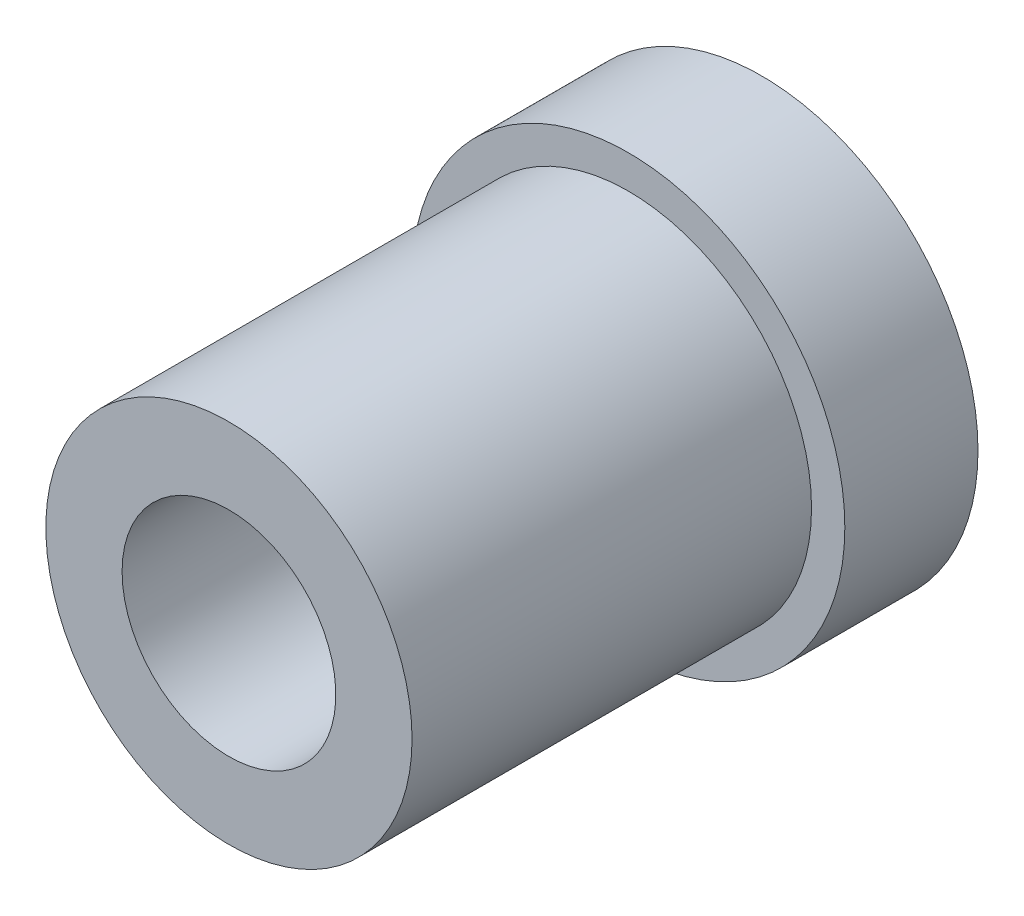
ISO-10303-21;
HEADER;
FILE_DESCRIPTION(('STEP AP214'),'2;1');
FILE_NAME('part.step','',(''),(''),'','','');
FILE_SCHEMA(('AUTOMOTIVE_DESIGN { 1 0 10303 214 1 1 1 1 }'));
ENDSEC;
DATA;
#1=APPLICATION_CONTEXT('core data for automotive mechanical design processes');
#2=APPLICATION_PROTOCOL_DEFINITION('international standard','automotive_design',2000,#1);
#3=PRODUCT_CONTEXT('',#1,'mechanical');
#4=PRODUCT('Part','Part','',(#3));
#5=PRODUCT_RELATED_PRODUCT_CATEGORY('part','',(#4));
#6=PRODUCT_DEFINITION_FORMATION('','',#4);
#7=PRODUCT_DEFINITION_CONTEXT('part definition',#1,'design');
#8=PRODUCT_DEFINITION('design','',#6,#7);
#9=PRODUCT_DEFINITION_SHAPE('','',#8);
#10=(LENGTH_UNIT() NAMED_UNIT(*) SI_UNIT(.MILLI.,.METRE.));
#11=(NAMED_UNIT(*) PLANE_ANGLE_UNIT() SI_UNIT($,.RADIAN.));
#12=(NAMED_UNIT(*) SI_UNIT($,.STERADIAN.) SOLID_ANGLE_UNIT());
#13=UNCERTAINTY_MEASURE_WITH_UNIT(LENGTH_MEASURE(1.E-05),#10,'distance_accuracy_value','');
#14=(GEOMETRIC_REPRESENTATION_CONTEXT(3) GLOBAL_UNCERTAINTY_ASSIGNED_CONTEXT((#13)) GLOBAL_UNIT_ASSIGNED_CONTEXT((#10,
#11,#12)) REPRESENTATION_CONTEXT('',''));
#15=CARTESIAN_POINT('',(0.,0.,0.));
#16=DIRECTION('',(0.,0.,1.));
#17=DIRECTION('',(1.,0.,0.));
#18=AXIS2_PLACEMENT_3D('',#15,#16,#17);
#19=CARTESIAN_POINT('',(0.,0.,20.));
#20=DIRECTION('',(0.,0.,-1.));
#21=DIRECTION('',(-1.,0.,0.));
#22=AXIS2_PLACEMENT_3D('',#19,#20,#21);
#23=CYLINDRICAL_SURFACE('',#22,32.5);
#24=CARTESIAN_POINT('',(0.,0.,20.));
#25=DIRECTION('',(0.,0.,1.));
#26=DIRECTION('',(1.,0.,0.));
#27=AXIS2_PLACEMENT_3D('',#24,#25,#26);
#28=CIRCLE('',#27,32.5);
#29=CARTESIAN_POINT('',(32.5,0.,20.));
#30=VERTEX_POINT('',#29);
#31=EDGE_CURVE('E10',#30,#30,#28,.T.);
#32=ORIENTED_EDGE('',*,*,#31,.F.);
#33=EDGE_LOOP('',(#32));
#34=FACE_BOUND('',#33,.T.);
#35=CARTESIAN_POINT('',(0.,0.,0.));
#36=DIRECTION('',(0.,0.,1.));
#37=DIRECTION('',(1.,0.,0.));
#38=AXIS2_PLACEMENT_3D('',#35,#36,#37);
#39=CIRCLE('',#38,32.5);
#40=CARTESIAN_POINT('',(32.5,0.,0.));
#41=VERTEX_POINT('',#40);
#42=EDGE_CURVE('E34',#41,#41,#39,.T.);
#43=ORIENTED_EDGE('',*,*,#42,.T.);
#44=EDGE_LOOP('',(#43));
#45=FACE_BOUND('',#44,.T.);
#46=ADVANCED_FACE('F31',(#34,#45),#23,.T.);
#47=CARTESIAN_POINT('',(0.,0.,20.));
#48=DIRECTION('',(0.,0.,1.));
#49=DIRECTION('',(1.,0.,0.));
#50=AXIS2_PLACEMENT_3D('',#47,#48,#49);
#51=PLANE('',#50);
#52=CARTESIAN_POINT('',(0.,0.,20.));
#53=DIRECTION('',(0.,0.,1.));
#54=DIRECTION('',(1.,0.,0.));
#55=AXIS2_PLACEMENT_3D('',#52,#53,#54);
#56=CIRCLE('',#55,27.5);
#57=CARTESIAN_POINT('',(27.5,0.,20.));
#58=VERTEX_POINT('',#57);
#59=EDGE_CURVE('E41',#58,#58,#56,.F.);
#60=ORIENTED_EDGE('',*,*,#59,.T.);
#61=EDGE_LOOP('',(#60));
#62=FACE_BOUND('',#61,.T.);
#63=ORIENTED_EDGE('',*,*,#31,.T.);
#64=EDGE_LOOP('',(#63));
#65=FACE_BOUND('',#64,.T.);
#66=ADVANCED_FACE('F68',(#62,#65),#51,.T.);
#67=CARTESIAN_POINT('',(0.,0.,0.));
#68=DIRECTION('',(0.,0.,1.));
#69=DIRECTION('',(1.,0.,0.));
#70=AXIS2_PLACEMENT_3D('',#67,#68,#69);
#71=PLANE('',#70);
#72=CARTESIAN_POINT('',(0.,0.,0.));
#73=DIRECTION('',(0.,0.,-1.));
#74=DIRECTION('',(-1.,0.,0.));
#75=AXIS2_PLACEMENT_3D('',#72,#73,#74);
#76=CIRCLE('',#75,16.05);
#77=CARTESIAN_POINT('',(-16.05,0.,0.));
#78=VERTEX_POINT('',#77);
#79=EDGE_CURVE('E49',#78,#78,#76,.T.);
#80=ORIENTED_EDGE('',*,*,#79,.F.);
#81=EDGE_LOOP('',(#80));
#82=FACE_BOUND('',#81,.T.);
#83=ORIENTED_EDGE('',*,*,#42,.F.);
#84=EDGE_LOOP('',(#83));
#85=FACE_BOUND('',#84,.T.);
#86=ADVANCED_FACE('F64',(#82,#85),#71,.F.);
#87=CARTESIAN_POINT('',(0.,0.,80.));
#88=DIRECTION('',(0.,0.,-1.));
#89=DIRECTION('',(-1.,0.,0.));
#90=AXIS2_PLACEMENT_3D('',#87,#88,#89);
#91=CYLINDRICAL_SURFACE('',#90,27.5);
#92=ORIENTED_EDGE('',*,*,#59,.F.);
#93=EDGE_LOOP('',(#92));
#94=FACE_BOUND('',#93,.T.);
#95=CARTESIAN_POINT('',(0.,0.,80.));
#96=DIRECTION('',(0.,0.,1.));
#97=DIRECTION('',(1.,0.,0.));
#98=AXIS2_PLACEMENT_3D('',#95,#96,#97);
#99=CIRCLE('',#98,27.5);
#100=CARTESIAN_POINT('',(27.5,0.,80.));
#101=VERTEX_POINT('',#100);
#102=EDGE_CURVE('E45',#101,#101,#99,.T.);
#103=ORIENTED_EDGE('',*,*,#102,.F.);
#104=EDGE_LOOP('',(#103));
#105=FACE_BOUND('',#104,.T.);
#106=ADVANCED_FACE('F67',(#94,#105),#91,.T.);
#107=CARTESIAN_POINT('',(0.,0.,80.));
#108=DIRECTION('',(0.,0.,1.));
#109=DIRECTION('',(1.,0.,0.));
#110=AXIS2_PLACEMENT_3D('',#107,#108,#109);
#111=PLANE('',#110);
#112=CARTESIAN_POINT('',(0.,0.,80.));
#113=DIRECTION('',(0.,0.,-1.));
#114=DIRECTION('',(-1.,0.,0.));
#115=AXIS2_PLACEMENT_3D('',#112,#113,#114);
#116=CIRCLE('',#115,16.05);
#117=CARTESIAN_POINT('',(-16.05,0.,80.));
#118=VERTEX_POINT('',#117);
#119=EDGE_CURVE('E48',#118,#118,#116,.T.);
#120=ORIENTED_EDGE('',*,*,#119,.T.);
#121=EDGE_LOOP('',(#120));
#122=FACE_BOUND('',#121,.T.);
#123=ORIENTED_EDGE('',*,*,#102,.T.);
#124=EDGE_LOOP('',(#123));
#125=FACE_BOUND('',#124,.T.);
#126=ADVANCED_FACE('F55',(#122,#125),#111,.T.);
#127=CARTESIAN_POINT('',(0.,0.,80.));
#128=DIRECTION('',(0.,0.,-1.));
#129=DIRECTION('',(-1.,0.,0.));
#130=AXIS2_PLACEMENT_3D('',#127,#128,#129);
#131=CYLINDRICAL_SURFACE('',#130,16.05);
#132=ORIENTED_EDGE('',*,*,#119,.F.);
#133=EDGE_LOOP('',(#132));
#134=FACE_BOUND('',#133,.T.);
#135=ORIENTED_EDGE('',*,*,#79,.T.);
#136=EDGE_LOOP('',(#135));
#137=FACE_BOUND('',#136,.T.);
#138=ADVANCED_FACE('F58',(#134,#137),#131,.F.);
#139=CLOSED_SHELL('',(#46,#66,#86,#106,#126,#138));
#140=MANIFOLD_SOLID_BREP('B2',#139);
#141=ADVANCED_BREP_SHAPE_REPRESENTATION('',(#18,#140),#14);
#142=SHAPE_DEFINITION_REPRESENTATION(#9,#141);
ENDSEC;
END-ISO-10303-21;
